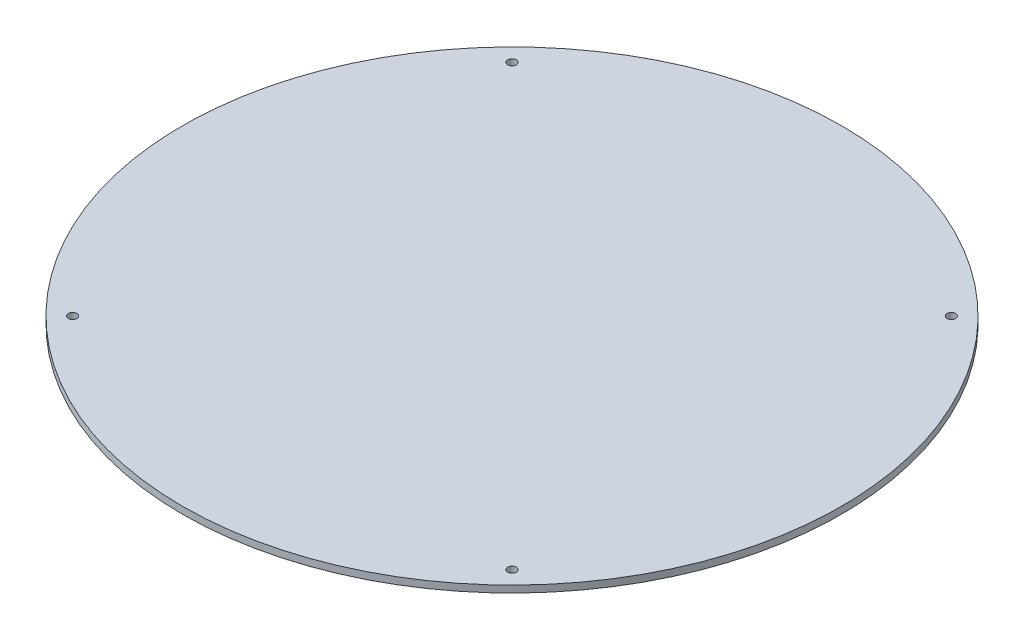
ISO-10303-21;
HEADER;
FILE_DESCRIPTION(('STEP AP214'),'2;1');
FILE_NAME('part.step','',(''),(''),'','','');
FILE_SCHEMA(('AUTOMOTIVE_DESIGN { 1 0 10303 214 1 1 1 1 }'));
ENDSEC;
DATA;
#1=APPLICATION_CONTEXT('core data for automotive mechanical design processes');
#2=APPLICATION_PROTOCOL_DEFINITION('international standard','automotive_design',2000,#1);
#3=PRODUCT_CONTEXT('',#1,'mechanical');
#4=PRODUCT('Part','Part','',(#3));
#5=PRODUCT_RELATED_PRODUCT_CATEGORY('part','',(#4));
#6=PRODUCT_DEFINITION_FORMATION('','',#4);
#7=PRODUCT_DEFINITION_CONTEXT('part definition',#1,'design');
#8=PRODUCT_DEFINITION('design','',#6,#7);
#9=PRODUCT_DEFINITION_SHAPE('','',#8);
#10=(LENGTH_UNIT() NAMED_UNIT(*) SI_UNIT(.MILLI.,.METRE.));
#11=(NAMED_UNIT(*) PLANE_ANGLE_UNIT() SI_UNIT($,.RADIAN.));
#12=(NAMED_UNIT(*) SI_UNIT($,.STERADIAN.) SOLID_ANGLE_UNIT());
#13=UNCERTAINTY_MEASURE_WITH_UNIT(LENGTH_MEASURE(1.E-05),#10,'distance_accuracy_value','');
#14=(GEOMETRIC_REPRESENTATION_CONTEXT(3) GLOBAL_UNCERTAINTY_ASSIGNED_CONTEXT((#13)) GLOBAL_UNIT_ASSIGNED_CONTEXT((#10,
#11,#12)) REPRESENTATION_CONTEXT('',''));
#15=CARTESIAN_POINT('',(0.,0.,0.));
#16=DIRECTION('',(0.,0.,1.));
#17=DIRECTION('',(1.,0.,0.));
#18=AXIS2_PLACEMENT_3D('',#15,#16,#17);
#19=CARTESIAN_POINT('',(0.,1.6,0.));
#20=DIRECTION('',(0.,1.,0.));
#21=DIRECTION('',(0.,0.,1.));
#22=AXIS2_PLACEMENT_3D('',#19,#20,#21);
#23=PLANE('',#22);
#24=CARTESIAN_POINT('',(50.8,1.6,50.8));
#25=DIRECTION('',(0.,1.,0.));
#26=DIRECTION('',(0.,0.,-1.));
#27=AXIS2_PLACEMENT_3D('',#24,#25,#26);
#28=CIRCLE('',#27,0.999999999999998);
#29=CARTESIAN_POINT('',(50.8,1.6,49.8));
#30=VERTEX_POINT('',#29);
#31=EDGE_CURVE('E52',#30,#30,#28,.T.);
#32=ORIENTED_EDGE('',*,*,#31,.F.);
#33=EDGE_LOOP('',(#32));
#34=FACE_BOUND('',#33,.T.);
#35=CARTESIAN_POINT('',(50.8,1.6,-50.8));
#36=DIRECTION('',(0.,1.,0.));
#37=DIRECTION('',(0.,0.,1.));
#38=AXIS2_PLACEMENT_3D('',#35,#36,#37);
#39=CIRCLE('',#38,0.999999999999998);
#40=CARTESIAN_POINT('',(50.8,1.6,-49.8));
#41=VERTEX_POINT('',#40);
#42=EDGE_CURVE('E41',#41,#41,#39,.T.);
#43=ORIENTED_EDGE('',*,*,#42,.F.);
#44=EDGE_LOOP('',(#43));
#45=FACE_BOUND('',#44,.T.);
#46=CARTESIAN_POINT('',(0.,1.6,0.));
#47=DIRECTION('',(0.,1.,0.));
#48=DIRECTION('',(0.,0.,1.));
#49=AXIS2_PLACEMENT_3D('',#46,#47,#48);
#50=CIRCLE('',#49,76.2);
#51=CARTESIAN_POINT('',(0.,1.6,76.2));
#52=VERTEX_POINT('',#51);
#53=EDGE_CURVE('E10',#52,#52,#50,.T.);
#54=ORIENTED_EDGE('',*,*,#53,.T.);
#55=EDGE_LOOP('',(#54));
#56=FACE_BOUND('',#55,.T.);
#57=CARTESIAN_POINT('',(-50.8,1.6,-50.8));
#58=DIRECTION('',(0.,1.,0.));
#59=DIRECTION('',(0.,0.,-1.));
#60=AXIS2_PLACEMENT_3D('',#57,#58,#59);
#61=CIRCLE('',#60,0.999999999999998);
#62=CARTESIAN_POINT('',(-50.8,1.6,-51.8));
#63=VERTEX_POINT('',#62);
#64=EDGE_CURVE('E46',#63,#63,#61,.T.);
#65=ORIENTED_EDGE('',*,*,#64,.F.);
#66=EDGE_LOOP('',(#65));
#67=FACE_BOUND('',#66,.T.);
#68=CARTESIAN_POINT('',(-50.8,1.6,50.8));
#69=DIRECTION('',(0.,1.,0.));
#70=DIRECTION('',(0.,0.,1.));
#71=AXIS2_PLACEMENT_3D('',#68,#69,#70);
#72=CIRCLE('',#71,0.999999999999998);
#73=CARTESIAN_POINT('',(-50.8,1.6,51.8));
#74=VERTEX_POINT('',#73);
#75=EDGE_CURVE('E58',#74,#74,#72,.T.);
#76=ORIENTED_EDGE('',*,*,#75,.F.);
#77=EDGE_LOOP('',(#76));
#78=FACE_BOUND('',#77,.T.);
#79=ADVANCED_FACE('F30',(#34,#45,#56,#67,#78),#23,.T.);
#80=CARTESIAN_POINT('',(0.,0.,0.));
#81=DIRECTION('',(0.,1.,0.));
#82=DIRECTION('',(0.,0.,1.));
#83=AXIS2_PLACEMENT_3D('',#80,#81,#82);
#84=PLANE('',#83);
#85=CARTESIAN_POINT('',(0.,0.,0.));
#86=DIRECTION('',(0.,1.,0.));
#87=DIRECTION('',(0.,0.,1.));
#88=AXIS2_PLACEMENT_3D('',#85,#86,#87);
#89=CIRCLE('',#88,76.2);
#90=CARTESIAN_POINT('',(0.,0.,76.2));
#91=VERTEX_POINT('',#90);
#92=EDGE_CURVE('E34',#91,#91,#89,.T.);
#93=ORIENTED_EDGE('',*,*,#92,.F.);
#94=EDGE_LOOP('',(#93));
#95=FACE_BOUND('',#94,.T.);
#96=CARTESIAN_POINT('',(50.8,0.,-50.8));
#97=DIRECTION('',(0.,1.,0.));
#98=DIRECTION('',(0.,0.,1.));
#99=AXIS2_PLACEMENT_3D('',#96,#97,#98);
#100=CIRCLE('',#99,0.999999999999998);
#101=CARTESIAN_POINT('',(50.8,0.,-49.8));
#102=VERTEX_POINT('',#101);
#103=EDGE_CURVE('E43',#102,#102,#100,.T.);
#104=ORIENTED_EDGE('',*,*,#103,.T.);
#105=EDGE_LOOP('',(#104));
#106=FACE_BOUND('',#105,.T.);
#107=CARTESIAN_POINT('',(-50.8,0.,-50.8));
#108=DIRECTION('',(0.,1.,0.));
#109=DIRECTION('',(0.,0.,-1.));
#110=AXIS2_PLACEMENT_3D('',#107,#108,#109);
#111=CIRCLE('',#110,0.999999999999998);
#112=CARTESIAN_POINT('',(-50.8,0.,-51.8));
#113=VERTEX_POINT('',#112);
#114=EDGE_CURVE('E49',#113,#113,#111,.T.);
#115=ORIENTED_EDGE('',*,*,#114,.T.);
#116=EDGE_LOOP('',(#115));
#117=FACE_BOUND('',#116,.T.);
#118=CARTESIAN_POINT('',(50.8,0.,50.8));
#119=DIRECTION('',(0.,1.,0.));
#120=DIRECTION('',(0.,0.,-1.));
#121=AXIS2_PLACEMENT_3D('',#118,#119,#120);
#122=CIRCLE('',#121,0.999999999999998);
#123=CARTESIAN_POINT('',(50.8,0.,49.8));
#124=VERTEX_POINT('',#123);
#125=EDGE_CURVE('E55',#124,#124,#122,.T.);
#126=ORIENTED_EDGE('',*,*,#125,.T.);
#127=EDGE_LOOP('',(#126));
#128=FACE_BOUND('',#127,.T.);
#129=CARTESIAN_POINT('',(-50.8,0.,50.8));
#130=DIRECTION('',(0.,1.,0.));
#131=DIRECTION('',(0.,0.,1.));
#132=AXIS2_PLACEMENT_3D('',#129,#130,#131);
#133=CIRCLE('',#132,0.999999999999998);
#134=CARTESIAN_POINT('',(-50.8,0.,51.8));
#135=VERTEX_POINT('',#134);
#136=EDGE_CURVE('E61',#135,#135,#133,.T.);
#137=ORIENTED_EDGE('',*,*,#136,.T.);
#138=EDGE_LOOP('',(#137));
#139=FACE_BOUND('',#138,.T.);
#140=ADVANCED_FACE('F71',(#95,#106,#117,#128,#139),#84,.F.);
#141=CARTESIAN_POINT('',(0.,1.6,0.));
#142=DIRECTION('',(0.,-1.,0.));
#143=DIRECTION('',(0.,0.,-1.));
#144=AXIS2_PLACEMENT_3D('',#141,#142,#143);
#145=CYLINDRICAL_SURFACE('',#144,76.2);
#146=ORIENTED_EDGE('',*,*,#53,.F.);
#147=EDGE_LOOP('',(#146));
#148=FACE_BOUND('',#147,.T.);
#149=ORIENTED_EDGE('',*,*,#92,.T.);
#150=EDGE_LOOP('',(#149));
#151=FACE_BOUND('',#150,.T.);
#152=ADVANCED_FACE('F32',(#148,#151),#145,.T.);
#153=CARTESIAN_POINT('',(50.8,1.6,-50.8));
#154=DIRECTION('',(0.,-1.,0.));
#155=DIRECTION('',(0.,0.,-1.));
#156=AXIS2_PLACEMENT_3D('',#153,#154,#155);
#157=CYLINDRICAL_SURFACE('',#156,0.999999999999998);
#158=ORIENTED_EDGE('',*,*,#42,.T.);
#159=EDGE_LOOP('',(#158));
#160=FACE_BOUND('',#159,.T.);
#161=ORIENTED_EDGE('',*,*,#103,.F.);
#162=EDGE_LOOP('',(#161));
#163=FACE_BOUND('',#162,.T.);
#164=ADVANCED_FACE('F81',(#160,#163),#157,.F.);
#165=CARTESIAN_POINT('',(-50.8,1.6,-50.8));
#166=DIRECTION('',(0.,-1.,0.));
#167=DIRECTION('',(0.,0.,-1.));
#168=AXIS2_PLACEMENT_3D('',#165,#166,#167);
#169=CYLINDRICAL_SURFACE('',#168,0.999999999999998);
#170=ORIENTED_EDGE('',*,*,#64,.T.);
#171=EDGE_LOOP('',(#170));
#172=FACE_BOUND('',#171,.T.);
#173=ORIENTED_EDGE('',*,*,#114,.F.);
#174=EDGE_LOOP('',(#173));
#175=FACE_BOUND('',#174,.T.);
#176=ADVANCED_FACE('F84',(#172,#175),#169,.F.);
#177=CARTESIAN_POINT('',(50.8,1.6,50.8));
#178=DIRECTION('',(0.,-1.,0.));
#179=DIRECTION('',(0.,0.,-1.));
#180=AXIS2_PLACEMENT_3D('',#177,#178,#179);
#181=CYLINDRICAL_SURFACE('',#180,0.999999999999998);
#182=ORIENTED_EDGE('',*,*,#31,.T.);
#183=EDGE_LOOP('',(#182));
#184=FACE_BOUND('',#183,.T.);
#185=ORIENTED_EDGE('',*,*,#125,.F.);
#186=EDGE_LOOP('',(#185));
#187=FACE_BOUND('',#186,.T.);
#188=ADVANCED_FACE('F88',(#184,#187),#181,.F.);
#189=CARTESIAN_POINT('',(-50.8,1.6,50.8));
#190=DIRECTION('',(0.,-1.,0.));
#191=DIRECTION('',(0.,0.,-1.));
#192=AXIS2_PLACEMENT_3D('',#189,#190,#191);
#193=CYLINDRICAL_SURFACE('',#192,0.999999999999998);
#194=ORIENTED_EDGE('',*,*,#75,.T.);
#195=EDGE_LOOP('',(#194));
#196=FACE_BOUND('',#195,.T.);
#197=ORIENTED_EDGE('',*,*,#136,.F.);
#198=EDGE_LOOP('',(#197));
#199=FACE_BOUND('',#198,.T.);
#200=ADVANCED_FACE('F67',(#196,#199),#193,.F.);
#201=CLOSED_SHELL('',(#79,#140,#152,#164,#176,#188,#200));
#202=MANIFOLD_SOLID_BREP('B2',#201);
#203=ADVANCED_BREP_SHAPE_REPRESENTATION('',(#18,#202),#14);
#204=SHAPE_DEFINITION_REPRESENTATION(#9,#203);
ENDSEC;
END-ISO-10303-21;
